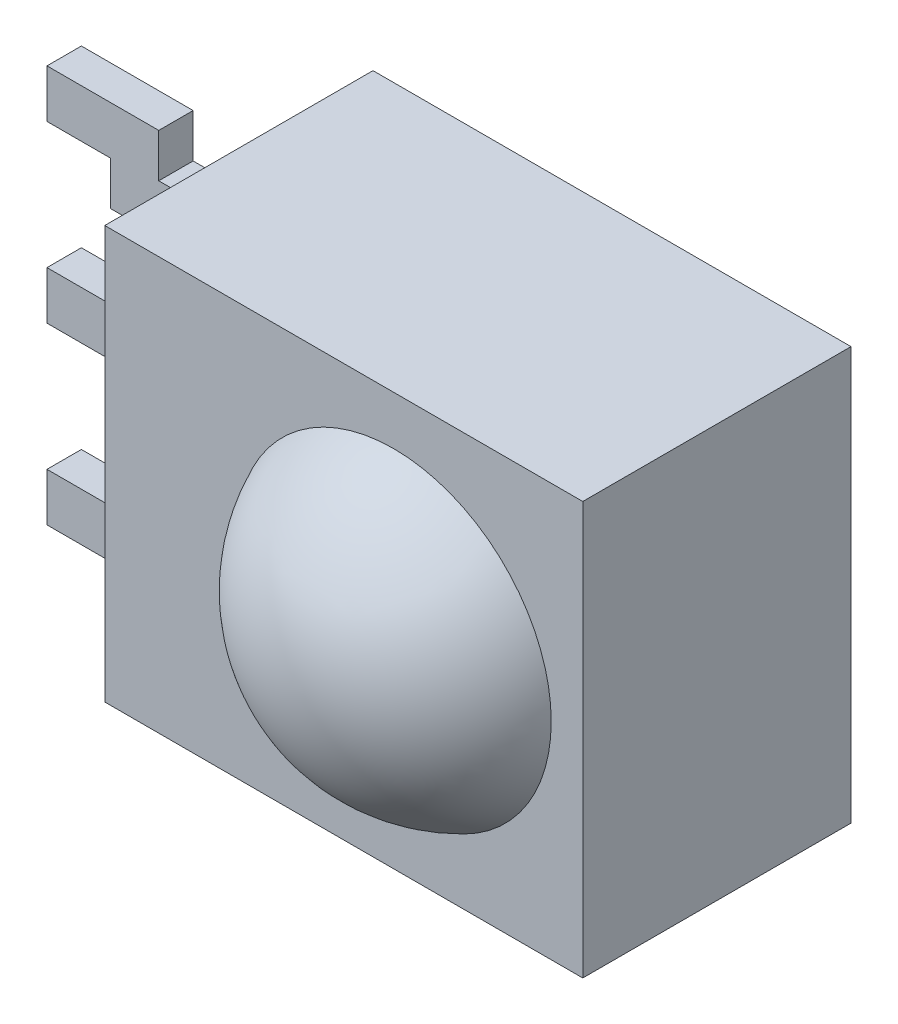
ISO-10303-21;
HEADER;
FILE_DESCRIPTION(('STEP AP214'),'2;1');
FILE_NAME('part.step','',(''),(''),'','','');
FILE_SCHEMA(('AUTOMOTIVE_DESIGN { 1 0 10303 214 1 1 1 1 }'));
ENDSEC;
DATA;
#1=APPLICATION_CONTEXT('core data for automotive mechanical design processes');
#2=APPLICATION_PROTOCOL_DEFINITION('international standard','automotive_design',2000,#1);
#3=PRODUCT_CONTEXT('',#1,'mechanical');
#4=PRODUCT('Part','Part','',(#3));
#5=PRODUCT_RELATED_PRODUCT_CATEGORY('part','',(#4));
#6=PRODUCT_DEFINITION_FORMATION('','',#4);
#7=PRODUCT_DEFINITION_CONTEXT('part definition',#1,'design');
#8=PRODUCT_DEFINITION('design','',#6,#7);
#9=PRODUCT_DEFINITION_SHAPE('','',#8);
#10=(LENGTH_UNIT() NAMED_UNIT(*) SI_UNIT(.MILLI.,.METRE.));
#11=(NAMED_UNIT(*) PLANE_ANGLE_UNIT() SI_UNIT($,.RADIAN.));
#12=(NAMED_UNIT(*) SI_UNIT($,.STERADIAN.) SOLID_ANGLE_UNIT());
#13=UNCERTAINTY_MEASURE_WITH_UNIT(LENGTH_MEASURE(1.E-05),#10,'distance_accuracy_value','');
#14=(GEOMETRIC_REPRESENTATION_CONTEXT(3) GLOBAL_UNCERTAINTY_ASSIGNED_CONTEXT((#13)) GLOBAL_UNIT_ASSIGNED_CONTEXT((#10,
#11,#12)) REPRESENTATION_CONTEXT('',''));
#15=CARTESIAN_POINT('',(0.,0.,0.));
#16=DIRECTION('',(0.,0.,1.));
#17=DIRECTION('',(1.,0.,0.));
#18=AXIS2_PLACEMENT_3D('',#15,#16,#17);
#19=CARTESIAN_POINT('',(-6.01499999999999,3.6678429995562,21.2054494009789));
#20=DIRECTION('',(1.,0.,0.));
#21=DIRECTION('',(0.,1.,0.));
#22=AXIS2_PLACEMENT_3D('',#19,#20,#21);
#23=PLANE('',#22);
#24=DIRECTION('',(0.,1.,0.));
#25=VECTOR('',#24,1.);
#26=CARTESIAN_POINT('',(-6.01499999999999,-1.555,-0.25));
#27=LINE('',#26,#25);
#28=CARTESIAN_POINT('',(-6.01499999999999,-2.89,-0.25));
#29=VERTEX_POINT('',#28);
#30=CARTESIAN_POINT('',(-6.01499999999999,-2.19,-0.25));
#31=VERTEX_POINT('',#30);
#32=EDGE_CURVE('E121',#29,#31,#27,.T.);
#33=ORIENTED_EDGE('',*,*,#32,.F.);
#34=DIRECTION('',(0.,0.,-1.));
#35=VECTOR('',#34,1.);
#36=CARTESIAN_POINT('',(-6.01499999999999,-2.89,-0.25));
#37=LINE('',#36,#35);
#38=CARTESIAN_POINT('',(-6.01499999999999,-2.89,0.25));
#39=VERTEX_POINT('',#38);
#40=EDGE_CURVE('E62',#39,#29,#37,.T.);
#41=ORIENTED_EDGE('',*,*,#40,.F.);
#42=DIRECTION('',(0.,-1.,0.));
#43=VECTOR('',#42,1.);
#44=CARTESIAN_POINT('',(-6.01499999999999,-1.555,0.25));
#45=LINE('',#44,#43);
#46=CARTESIAN_POINT('',(-6.01499999999999,-2.19,0.25));
#47=VERTEX_POINT('',#46);
#48=EDGE_CURVE('E13',#47,#39,#45,.T.);
#49=ORIENTED_EDGE('',*,*,#48,.F.);
#50=DIRECTION('',(0.,0.,1.));
#51=VECTOR('',#50,1.);
#52=CARTESIAN_POINT('',(-6.01499999999999,-2.19,-0.25));
#53=LINE('',#52,#51);
#54=EDGE_CURVE('E109',#31,#47,#53,.T.);
#55=ORIENTED_EDGE('',*,*,#54,.F.);
#56=EDGE_LOOP('',(#33,#41,#49,#55));
#57=FACE_BOUND('',#56,.T.);
#58=ADVANCED_FACE('F47',(#57),#23,.F.);
#59=CARTESIAN_POINT('',(-5.60023252670426,-1.555,-0.25));
#60=DIRECTION('',(0.,0.,1.));
#61=DIRECTION('',(1.,0.,0.));
#62=AXIS2_PLACEMENT_3D('',#59,#60,#61);
#63=PLANE('',#62);
#64=DIRECTION('',(-1.,0.,0.));
#65=VECTOR('',#64,1.);
#66=CARTESIAN_POINT('',(-4.38999999999999,-2.89,-0.25));
#67=LINE('',#66,#65);
#68=CARTESIAN_POINT('',(-4.38999999999999,-2.89,-0.25));
#69=VERTEX_POINT('',#68);
#70=EDGE_CURVE('E55',#69,#29,#67,.T.);
#71=ORIENTED_EDGE('',*,*,#70,.T.);
#72=ORIENTED_EDGE('',*,*,#32,.T.);
#73=DIRECTION('',(-1.,0.,0.));
#74=VECTOR('',#73,1.);
#75=CARTESIAN_POINT('',(-5.08999999999999,-2.19,-0.25));
#76=LINE('',#75,#74);
#77=CARTESIAN_POINT('',(-5.08999999999999,-2.19,-0.25));
#78=VERTEX_POINT('',#77);
#79=EDGE_CURVE('E120',#78,#31,#76,.T.);
#80=ORIENTED_EDGE('',*,*,#79,.F.);
#81=DIRECTION('',(0.,-1.,0.));
#82=VECTOR('',#81,1.);
#83=CARTESIAN_POINT('',(-5.08999999999999,-1.555,-0.25));
#84=LINE('',#83,#82);
#85=CARTESIAN_POINT('',(-5.08999999999999,-1.555,-0.25));
#86=VERTEX_POINT('',#85);
#87=EDGE_CURVE('E147',#86,#78,#84,.T.);
#88=ORIENTED_EDGE('',*,*,#87,.F.);
#89=DIRECTION('',(1.,0.,0.));
#90=VECTOR('',#89,1.);
#91=CARTESIAN_POINT('',(-5.60023252670426,-1.555,-0.25));
#92=LINE('',#91,#90);
#93=CARTESIAN_POINT('',(-3.47499999999999,-1.555,-0.25));
#94=VERTEX_POINT('',#93);
#95=EDGE_CURVE('E163',#86,#94,#92,.T.);
#96=ORIENTED_EDGE('',*,*,#95,.T.);
#97=DIRECTION('',(0.,-1.,0.));
#98=VECTOR('',#97,1.);
#99=CARTESIAN_POINT('',(-3.47499999999999,-1.555,-0.25));
#100=LINE('',#99,#98);
#101=CARTESIAN_POINT('',(-3.47499999999999,-2.255,-0.25));
#102=VERTEX_POINT('',#101);
#103=EDGE_CURVE('E174',#94,#102,#100,.T.);
#104=ORIENTED_EDGE('',*,*,#103,.T.);
#105=DIRECTION('',(1.,0.,0.));
#106=VECTOR('',#105,1.);
#107=CARTESIAN_POINT('',(-5.60023252670426,-2.255,-0.25));
#108=LINE('',#107,#106);
#109=CARTESIAN_POINT('',(-4.38999999999999,-2.255,-0.25));
#110=VERTEX_POINT('',#109);
#111=EDGE_CURVE('E143',#110,#102,#108,.T.);
#112=ORIENTED_EDGE('',*,*,#111,.F.);
#113=DIRECTION('',(0.,-1.,0.));
#114=VECTOR('',#113,1.);
#115=CARTESIAN_POINT('',(-4.38999999999999,-2.255,-0.25));
#116=LINE('',#115,#114);
#117=EDGE_CURVE('E141',#110,#69,#116,.T.);
#118=ORIENTED_EDGE('',*,*,#117,.T.);
#119=EDGE_LOOP('',(#71,#72,#80,#88,#96,#104,#112,#118));
#120=FACE_BOUND('',#119,.T.);
#121=ADVANCED_FACE('F139',(#120),#63,.F.);
#122=CARTESIAN_POINT('',(-5.08999999999999,-2.19,-0.25));
#123=DIRECTION('',(0.,-1.,0.));
#124=DIRECTION('',(0.,0.,-1.));
#125=AXIS2_PLACEMENT_3D('',#122,#123,#124);
#126=PLANE('',#125);
#127=ORIENTED_EDGE('',*,*,#79,.T.);
#128=ORIENTED_EDGE('',*,*,#54,.T.);
#129=DIRECTION('',(-1.,0.,0.));
#130=VECTOR('',#129,1.);
#131=CARTESIAN_POINT('',(-5.08999999999999,-2.19,0.25));
#132=LINE('',#131,#130);
#133=CARTESIAN_POINT('',(-5.08999999999999,-2.19,0.25));
#134=VERTEX_POINT('',#133);
#135=EDGE_CURVE('E118',#134,#47,#132,.T.);
#136=ORIENTED_EDGE('',*,*,#135,.F.);
#137=DIRECTION('',(0.,0.,1.));
#138=VECTOR('',#137,1.);
#139=CARTESIAN_POINT('',(-5.08999999999999,-2.19,-0.25));
#140=LINE('',#139,#138);
#141=EDGE_CURVE('E151',#78,#134,#140,.T.);
#142=ORIENTED_EDGE('',*,*,#141,.F.);
#143=EDGE_LOOP('',(#127,#128,#136,#142));
#144=FACE_BOUND('',#143,.T.);
#145=ADVANCED_FACE('F116',(#144),#126,.F.);
#146=CARTESIAN_POINT('',(-4.38999999999999,-2.89,-0.25));
#147=DIRECTION('',(0.,1.,0.));
#148=DIRECTION('',(0.,0.,1.));
#149=AXIS2_PLACEMENT_3D('',#146,#147,#148);
#150=PLANE('',#149);
#151=DIRECTION('',(-1.,0.,0.));
#152=VECTOR('',#151,1.);
#153=CARTESIAN_POINT('',(-4.38999999999999,-2.89,0.25));
#154=LINE('',#153,#152);
#155=CARTESIAN_POINT('',(-4.38999999999999,-2.89,0.25));
#156=VERTEX_POINT('',#155);
#157=EDGE_CURVE('E127',#156,#39,#154,.T.);
#158=ORIENTED_EDGE('',*,*,#157,.T.);
#159=ORIENTED_EDGE('',*,*,#40,.T.);
#160=ORIENTED_EDGE('',*,*,#70,.F.);
#161=DIRECTION('',(0.,0.,-1.));
#162=VECTOR('',#161,1.);
#163=CARTESIAN_POINT('',(-4.38999999999999,-2.89,-0.25));
#164=LINE('',#163,#162);
#165=EDGE_CURVE('E130',#156,#69,#164,.T.);
#166=ORIENTED_EDGE('',*,*,#165,.F.);
#167=EDGE_LOOP('',(#158,#159,#160,#166));
#168=FACE_BOUND('',#167,.T.);
#169=ADVANCED_FACE('F49',(#168),#150,.F.);
#170=CARTESIAN_POINT('',(-5.08999999999999,-1.555,-0.25));
#171=DIRECTION('',(-1.,0.,0.));
#172=DIRECTION('',(0.,0.,1.));
#173=AXIS2_PLACEMENT_3D('',#170,#171,#172);
#174=PLANE('',#173);
#175=ORIENTED_EDGE('',*,*,#87,.T.);
#176=ORIENTED_EDGE('',*,*,#141,.T.);
#177=DIRECTION('',(0.,-1.,0.));
#178=VECTOR('',#177,1.);
#179=CARTESIAN_POINT('',(-5.08999999999999,-1.555,0.25));
#180=LINE('',#179,#178);
#181=CARTESIAN_POINT('',(-5.08999999999999,-1.555,0.25));
#182=VERTEX_POINT('',#181);
#183=EDGE_CURVE('E125',#182,#134,#180,.T.);
#184=ORIENTED_EDGE('',*,*,#183,.F.);
#185=DIRECTION('',(0.,0.,-1.));
#186=VECTOR('',#185,1.);
#187=CARTESIAN_POINT('',(-5.08999999999999,-1.555,-0.25));
#188=LINE('',#187,#186);
#189=EDGE_CURVE('E156',#182,#86,#188,.T.);
#190=ORIENTED_EDGE('',*,*,#189,.T.);
#191=EDGE_LOOP('',(#175,#176,#184,#190));
#192=FACE_BOUND('',#191,.T.);
#193=ADVANCED_FACE('F197',(#192),#174,.T.);
#194=CARTESIAN_POINT('',(-4.38999999999999,-2.255,-0.25));
#195=DIRECTION('',(1.,0.,0.));
#196=DIRECTION('',(0.,0.,-1.));
#197=AXIS2_PLACEMENT_3D('',#194,#195,#196);
#198=PLANE('',#197);
#199=DIRECTION('',(0.,-1.,0.));
#200=VECTOR('',#199,1.);
#201=CARTESIAN_POINT('',(-4.38999999999999,-2.255,0.25));
#202=LINE('',#201,#200);
#203=CARTESIAN_POINT('',(-4.38999999999999,-2.255,0.25));
#204=VERTEX_POINT('',#203);
#205=EDGE_CURVE('E148',#204,#156,#202,.T.);
#206=ORIENTED_EDGE('',*,*,#205,.T.);
#207=ORIENTED_EDGE('',*,*,#165,.T.);
#208=ORIENTED_EDGE('',*,*,#117,.F.);
#209=DIRECTION('',(0.,0.,1.));
#210=VECTOR('',#209,1.);
#211=CARTESIAN_POINT('',(-4.38999999999999,-2.255,-0.25));
#212=LINE('',#211,#210);
#213=EDGE_CURVE('E158',#110,#204,#212,.T.);
#214=ORIENTED_EDGE('',*,*,#213,.T.);
#215=EDGE_LOOP('',(#206,#207,#208,#214));
#216=FACE_BOUND('',#215,.T.);
#217=ADVANCED_FACE('F183',(#216),#198,.T.);
#218=CARTESIAN_POINT('',(-5.60023252670426,-1.555,-0.25));
#219=DIRECTION('',(0.,-1.,0.));
#220=DIRECTION('',(1.,0.,0.));
#221=AXIS2_PLACEMENT_3D('',#218,#219,#220);
#222=PLANE('',#221);
#223=ORIENTED_EDGE('',*,*,#189,.F.);
#224=DIRECTION('',(1.,0.,0.));
#225=VECTOR('',#224,1.);
#226=CARTESIAN_POINT('',(-5.60023252670426,-1.555,0.25));
#227=LINE('',#226,#225);
#228=CARTESIAN_POINT('',(-3.47499999999999,-1.555,0.25));
#229=VERTEX_POINT('',#228);
#230=EDGE_CURVE('E161',#182,#229,#227,.T.);
#231=ORIENTED_EDGE('',*,*,#230,.T.);
#232=DIRECTION('',(0.,0.,-1.));
#233=VECTOR('',#232,1.);
#234=CARTESIAN_POINT('',(-3.47499999999999,-1.555,-0.25));
#235=LINE('',#234,#233);
#236=EDGE_CURVE('E165',#229,#94,#235,.T.);
#237=ORIENTED_EDGE('',*,*,#236,.T.);
#238=ORIENTED_EDGE('',*,*,#95,.F.);
#239=EDGE_LOOP('',(#223,#231,#237,#238));
#240=FACE_BOUND('',#239,.T.);
#241=ADVANCED_FACE('F194',(#240),#222,.F.);
#242=CARTESIAN_POINT('',(-5.60023252670426,-1.555,0.25));
#243=DIRECTION('',(0.,0.,-1.));
#244=DIRECTION('',(-1.,0.,0.));
#245=AXIS2_PLACEMENT_3D('',#242,#243,#244);
#246=PLANE('',#245);
#247=ORIENTED_EDGE('',*,*,#135,.T.);
#248=ORIENTED_EDGE('',*,*,#48,.T.);
#249=ORIENTED_EDGE('',*,*,#157,.F.);
#250=ORIENTED_EDGE('',*,*,#205,.F.);
#251=DIRECTION('',(1.,0.,0.));
#252=VECTOR('',#251,1.);
#253=CARTESIAN_POINT('',(-5.60023252670426,-2.255,0.25));
#254=LINE('',#253,#252);
#255=CARTESIAN_POINT('',(-3.47499999999999,-2.255,0.25));
#256=VERTEX_POINT('',#255);
#257=EDGE_CURVE('E159',#204,#256,#254,.T.);
#258=ORIENTED_EDGE('',*,*,#257,.T.);
#259=DIRECTION('',(0.,1.,0.));
#260=VECTOR('',#259,1.);
#261=CARTESIAN_POINT('',(-3.47499999999999,-1.555,0.25));
#262=LINE('',#261,#260);
#263=EDGE_CURVE('E168',#256,#229,#262,.T.);
#264=ORIENTED_EDGE('',*,*,#263,.T.);
#265=ORIENTED_EDGE('',*,*,#230,.F.);
#266=ORIENTED_EDGE('',*,*,#183,.T.);
#267=EDGE_LOOP('',(#247,#248,#249,#250,#258,#264,#265,#266));
#268=FACE_BOUND('',#267,.T.);
#269=ADVANCED_FACE('F123',(#268),#246,.F.);
#270=CARTESIAN_POINT('',(-5.60023252670426,-2.255,-0.25));
#271=DIRECTION('',(0.,1.,0.));
#272=DIRECTION('',(-1.,0.,0.));
#273=AXIS2_PLACEMENT_3D('',#270,#271,#272);
#274=PLANE('',#273);
#275=ORIENTED_EDGE('',*,*,#213,.F.);
#276=ORIENTED_EDGE('',*,*,#111,.T.);
#277=DIRECTION('',(0.,0.,1.));
#278=VECTOR('',#277,1.);
#279=CARTESIAN_POINT('',(-3.47499999999999,-2.255,-0.25));
#280=LINE('',#279,#278);
#281=EDGE_CURVE('E171',#102,#256,#280,.T.);
#282=ORIENTED_EDGE('',*,*,#281,.T.);
#283=ORIENTED_EDGE('',*,*,#257,.F.);
#284=EDGE_LOOP('',(#275,#276,#282,#283));
#285=FACE_BOUND('',#284,.T.);
#286=ADVANCED_FACE('F185',(#285),#274,.F.);
#287=CARTESIAN_POINT('',(-3.47499999999999,-2.255,-0.25));
#288=DIRECTION('',(-1.,0.,0.));
#289=DIRECTION('',(0.,0.,1.));
#290=AXIS2_PLACEMENT_3D('',#287,#288,#289);
#291=PLANE('',#290);
#292=ORIENTED_EDGE('',*,*,#103,.F.);
#293=ORIENTED_EDGE('',*,*,#236,.F.);
#294=ORIENTED_EDGE('',*,*,#263,.F.);
#295=ORIENTED_EDGE('',*,*,#281,.F.);
#296=EDGE_LOOP('',(#292,#293,#294,#295));
#297=FACE_BOUND('',#296,.T.);
#298=ADVANCED_FACE('F191',(#297),#291,.F.);
#299=CLOSED_SHELL('',(#58,#121,#145,#169,#193,#217,#241,#269,#286,#298));
#300=MANIFOLD_SOLID_BREP('B2',#299);
#301=CARTESIAN_POINT('',(-6.01499999999999,3.6678429995562,21.2054494009789));
#302=DIRECTION('',(1.,0.,0.));
#303=DIRECTION('',(0.,1.,0.));
#304=AXIS2_PLACEMENT_3D('',#301,#302,#303);
#305=PLANE('',#304);
#306=DIRECTION('',(0.,1.,0.));
#307=VECTOR('',#306,1.);
#308=CARTESIAN_POINT('',(-6.01499999999999,0.35,-0.25));
#309=LINE('',#308,#307);
#310=CARTESIAN_POINT('',(-6.01499999999999,-0.35,-0.25));
#311=VERTEX_POINT('',#310);
#312=CARTESIAN_POINT('',(-6.01499999999999,0.35,-0.25));
#313=VERTEX_POINT('',#312);
#314=EDGE_CURVE('E353',#311,#313,#309,.T.);
#315=ORIENTED_EDGE('',*,*,#314,.F.);
#316=DIRECTION('',(0.,0.,-1.));
#317=VECTOR('',#316,1.);
#318=CARTESIAN_POINT('',(-6.01499999999999,-0.35,-0.25));
#319=LINE('',#318,#317);
#320=CARTESIAN_POINT('',(-6.01499999999999,-0.35,0.25));
#321=VERTEX_POINT('',#320);
#322=EDGE_CURVE('E357',#321,#311,#319,.T.);
#323=ORIENTED_EDGE('',*,*,#322,.F.);
#324=DIRECTION('',(0.,-1.,0.));
#325=VECTOR('',#324,1.);
#326=CARTESIAN_POINT('',(-6.01499999999999,0.35,0.25));
#327=LINE('',#326,#325);
#328=CARTESIAN_POINT('',(-6.01499999999999,0.35,0.25));
#329=VERTEX_POINT('',#328);
#330=EDGE_CURVE('E323',#329,#321,#327,.T.);
#331=ORIENTED_EDGE('',*,*,#330,.F.);
#332=DIRECTION('',(0.,0.,1.));
#333=VECTOR('',#332,1.);
#334=CARTESIAN_POINT('',(-6.01499999999999,0.35,-0.25));
#335=LINE('',#334,#333);
#336=EDGE_CURVE('E45',#313,#329,#335,.T.);
#337=ORIENTED_EDGE('',*,*,#336,.F.);
#338=EDGE_LOOP('',(#315,#323,#331,#337));
#339=FACE_BOUND('',#338,.T.);
#340=ADVANCED_FACE('F306',(#339),#305,.F.);
#341=CARTESIAN_POINT('',(-9.09773252670426,0.35,-0.25));
#342=DIRECTION('',(0.,0.,1.));
#343=DIRECTION('',(1.,0.,0.));
#344=AXIS2_PLACEMENT_3D('',#341,#342,#343);
#345=PLANE('',#344);
#346=DIRECTION('',(1.,0.,0.));
#347=VECTOR('',#346,1.);
#348=CARTESIAN_POINT('',(-9.09773252670426,-0.35,-0.25));
#349=LINE('',#348,#347);
#350=CARTESIAN_POINT('',(-3.47499999999999,-0.35,-0.25));
#351=VERTEX_POINT('',#350);
#352=EDGE_CURVE('E310',#311,#351,#349,.T.);
#353=ORIENTED_EDGE('',*,*,#352,.F.);
#354=ORIENTED_EDGE('',*,*,#314,.T.);
#355=DIRECTION('',(1.,0.,0.));
#356=VECTOR('',#355,1.);
#357=CARTESIAN_POINT('',(-9.09773252670426,0.35,-0.25));
#358=LINE('',#357,#356);
#359=CARTESIAN_POINT('',(-3.47499999999999,0.35,-0.25));
#360=VERTEX_POINT('',#359);
#361=EDGE_CURVE('E350',#313,#360,#358,.T.);
#362=ORIENTED_EDGE('',*,*,#361,.T.);
#363=DIRECTION('',(0.,-1.,0.));
#364=VECTOR('',#363,1.);
#365=CARTESIAN_POINT('',(-3.47499999999999,0.35,-0.25));
#366=LINE('',#365,#364);
#367=EDGE_CURVE('E362',#360,#351,#366,.T.);
#368=ORIENTED_EDGE('',*,*,#367,.T.);
#369=EDGE_LOOP('',(#353,#354,#362,#368));
#370=FACE_BOUND('',#369,.T.);
#371=ADVANCED_FACE('F308',(#370),#345,.F.);
#372=CARTESIAN_POINT('',(-9.09773252670426,-0.35,-0.25));
#373=DIRECTION('',(0.,1.,0.));
#374=DIRECTION('',(0.,0.,1.));
#375=AXIS2_PLACEMENT_3D('',#372,#373,#374);
#376=PLANE('',#375);
#377=DIRECTION('',(1.,0.,0.));
#378=VECTOR('',#377,1.);
#379=CARTESIAN_POINT('',(-9.09773252670426,-0.35,0.25));
#380=LINE('',#379,#378);
#381=CARTESIAN_POINT('',(-3.47499999999999,-0.35,0.25));
#382=VERTEX_POINT('',#381);
#383=EDGE_CURVE('E370',#321,#382,#380,.T.);
#384=ORIENTED_EDGE('',*,*,#383,.F.);
#385=ORIENTED_EDGE('',*,*,#322,.T.);
#386=ORIENTED_EDGE('',*,*,#352,.T.);
#387=DIRECTION('',(0.,0.,1.));
#388=VECTOR('',#387,1.);
#389=CARTESIAN_POINT('',(-3.47499999999999,-0.35,-0.25));
#390=LINE('',#389,#388);
#391=EDGE_CURVE('E371',#351,#382,#390,.T.);
#392=ORIENTED_EDGE('',*,*,#391,.T.);
#393=EDGE_LOOP('',(#384,#385,#386,#392));
#394=FACE_BOUND('',#393,.T.);
#395=ADVANCED_FACE('F381',(#394),#376,.F.);
#396=CARTESIAN_POINT('',(-9.09773252670426,0.35,0.25));
#397=DIRECTION('',(0.,0.,-1.));
#398=DIRECTION('',(-1.,0.,0.));
#399=AXIS2_PLACEMENT_3D('',#396,#397,#398);
#400=PLANE('',#399);
#401=DIRECTION('',(1.,0.,0.));
#402=VECTOR('',#401,1.);
#403=CARTESIAN_POINT('',(-9.09773252670426,0.35,0.25));
#404=LINE('',#403,#402);
#405=CARTESIAN_POINT('',(-3.47499999999999,0.35,0.25));
#406=VERTEX_POINT('',#405);
#407=EDGE_CURVE('E330',#329,#406,#404,.T.);
#408=ORIENTED_EDGE('',*,*,#407,.F.);
#409=ORIENTED_EDGE('',*,*,#330,.T.);
#410=ORIENTED_EDGE('',*,*,#383,.T.);
#411=DIRECTION('',(0.,1.,0.));
#412=VECTOR('',#411,1.);
#413=CARTESIAN_POINT('',(-3.47499999999999,0.35,0.25));
#414=LINE('',#413,#412);
#415=EDGE_CURVE('E369',#382,#406,#414,.T.);
#416=ORIENTED_EDGE('',*,*,#415,.T.);
#417=EDGE_LOOP('',(#408,#409,#410,#416));
#418=FACE_BOUND('',#417,.T.);
#419=ADVANCED_FACE('F380',(#418),#400,.F.);
#420=CARTESIAN_POINT('',(-9.09773252670426,0.35,-0.25));
#421=DIRECTION('',(0.,-1.,0.));
#422=DIRECTION('',(0.,0.,-1.));
#423=AXIS2_PLACEMENT_3D('',#420,#421,#422);
#424=PLANE('',#423);
#425=ORIENTED_EDGE('',*,*,#361,.F.);
#426=ORIENTED_EDGE('',*,*,#336,.T.);
#427=ORIENTED_EDGE('',*,*,#407,.T.);
#428=DIRECTION('',(0.,0.,-1.));
#429=VECTOR('',#428,1.);
#430=CARTESIAN_POINT('',(-3.47499999999999,0.35,-0.25));
#431=LINE('',#430,#429);
#432=EDGE_CURVE('E316',#406,#360,#431,.T.);
#433=ORIENTED_EDGE('',*,*,#432,.T.);
#434=EDGE_LOOP('',(#425,#426,#427,#433));
#435=FACE_BOUND('',#434,.T.);
#436=ADVANCED_FACE('F359',(#435),#424,.F.);
#437=CARTESIAN_POINT('',(-3.47499999999999,-0.35,-0.25));
#438=DIRECTION('',(-1.,0.,0.));
#439=DIRECTION('',(0.,0.,1.));
#440=AXIS2_PLACEMENT_3D('',#437,#438,#439);
#441=PLANE('',#440);
#442=ORIENTED_EDGE('',*,*,#367,.F.);
#443=ORIENTED_EDGE('',*,*,#432,.F.);
#444=ORIENTED_EDGE('',*,*,#415,.F.);
#445=ORIENTED_EDGE('',*,*,#391,.F.);
#446=EDGE_LOOP('',(#442,#443,#444,#445));
#447=FACE_BOUND('',#446,.T.);
#448=ADVANCED_FACE('F384',(#447),#441,.F.);
#449=CLOSED_SHELL('',(#340,#371,#395,#419,#436,#448));
#450=MANIFOLD_SOLID_BREP('B7',#449);
#451=CARTESIAN_POINT('',(-6.01499999999999,3.6678429995562,21.2054494009789));
#452=DIRECTION('',(1.,0.,0.));
#453=DIRECTION('',(0.,1.,0.));
#454=AXIS2_PLACEMENT_3D('',#451,#452,#453);
#455=PLANE('',#454);
#456=DIRECTION('',(0.,1.,0.));
#457=VECTOR('',#456,1.);
#458=CARTESIAN_POINT('',(-6.01499999999999,2.255,-0.25));
#459=LINE('',#458,#457);
#460=CARTESIAN_POINT('',(-6.01499999999999,2.19,-0.25));
#461=VERTEX_POINT('',#460);
#462=CARTESIAN_POINT('',(-6.01499999999999,2.89,-0.25));
#463=VERTEX_POINT('',#462);
#464=EDGE_CURVE('E522',#461,#463,#459,.T.);
#465=ORIENTED_EDGE('',*,*,#464,.F.);
#466=DIRECTION('',(0.,0.,-1.));
#467=VECTOR('',#466,1.);
#468=CARTESIAN_POINT('',(-6.01499999999999,2.19,-0.25));
#469=LINE('',#468,#467);
#470=CARTESIAN_POINT('',(-6.01499999999999,2.19,0.25));
#471=VERTEX_POINT('',#470);
#472=EDGE_CURVE('E463',#471,#461,#469,.T.);
#473=ORIENTED_EDGE('',*,*,#472,.F.);
#474=DIRECTION('',(0.,-1.,0.));
#475=VECTOR('',#474,1.);
#476=CARTESIAN_POINT('',(-6.01499999999999,2.255,0.25));
#477=LINE('',#476,#475);
#478=CARTESIAN_POINT('',(-6.01499999999999,2.89,0.25));
#479=VERTEX_POINT('',#478);
#480=EDGE_CURVE('E304',#479,#471,#477,.T.);
#481=ORIENTED_EDGE('',*,*,#480,.F.);
#482=DIRECTION('',(0.,0.,1.));
#483=VECTOR('',#482,1.);
#484=CARTESIAN_POINT('',(-6.01499999999999,2.89,-0.25));
#485=LINE('',#484,#483);
#486=EDGE_CURVE('E510',#463,#479,#485,.T.);
#487=ORIENTED_EDGE('',*,*,#486,.F.);
#488=EDGE_LOOP('',(#465,#473,#481,#487));
#489=FACE_BOUND('',#488,.T.);
#490=ADVANCED_FACE('F448',(#489),#455,.F.);
#491=CARTESIAN_POINT('',(-5.60023252670426,2.255,-0.25));
#492=DIRECTION('',(0.,0.,1.));
#493=DIRECTION('',(1.,0.,0.));
#494=AXIS2_PLACEMENT_3D('',#491,#492,#493);
#495=PLANE('',#494);
#496=DIRECTION('',(-1.,0.,0.));
#497=VECTOR('',#496,1.);
#498=CARTESIAN_POINT('',(-5.08999999999999,2.19,-0.25));
#499=LINE('',#498,#497);
#500=CARTESIAN_POINT('',(-5.08999999999999,2.19,-0.25));
#501=VERTEX_POINT('',#500);
#502=EDGE_CURVE('E456',#501,#461,#499,.T.);
#503=ORIENTED_EDGE('',*,*,#502,.T.);
#504=ORIENTED_EDGE('',*,*,#464,.T.);
#505=DIRECTION('',(-1.,0.,0.));
#506=VECTOR('',#505,1.);
#507=CARTESIAN_POINT('',(-4.38999999999999,2.89,-0.25));
#508=LINE('',#507,#506);
#509=CARTESIAN_POINT('',(-4.38999999999999,2.89,-0.25));
#510=VERTEX_POINT('',#509);
#511=EDGE_CURVE('E521',#510,#463,#508,.T.);
#512=ORIENTED_EDGE('',*,*,#511,.F.);
#513=DIRECTION('',(0.,1.,0.));
#514=VECTOR('',#513,1.);
#515=CARTESIAN_POINT('',(-4.38999999999999,2.255,-0.25));
#516=LINE('',#515,#514);
#517=CARTESIAN_POINT('',(-4.38999999999999,2.255,-0.25));
#518=VERTEX_POINT('',#517);
#519=EDGE_CURVE('E548',#518,#510,#516,.T.);
#520=ORIENTED_EDGE('',*,*,#519,.F.);
#521=DIRECTION('',(1.,0.,0.));
#522=VECTOR('',#521,1.);
#523=CARTESIAN_POINT('',(-5.60023252670426,2.255,-0.25));
#524=LINE('',#523,#522);
#525=CARTESIAN_POINT('',(-3.47499999999999,2.255,-0.25));
#526=VERTEX_POINT('',#525);
#527=EDGE_CURVE('E564',#518,#526,#524,.T.);
#528=ORIENTED_EDGE('',*,*,#527,.T.);
#529=DIRECTION('',(0.,-1.,0.));
#530=VECTOR('',#529,1.);
#531=CARTESIAN_POINT('',(-3.47499999999999,2.255,-0.25));
#532=LINE('',#531,#530);
#533=CARTESIAN_POINT('',(-3.47499999999999,1.555,-0.25));
#534=VERTEX_POINT('',#533);
#535=EDGE_CURVE('E575',#526,#534,#532,.T.);
#536=ORIENTED_EDGE('',*,*,#535,.T.);
#537=DIRECTION('',(1.,0.,0.));
#538=VECTOR('',#537,1.);
#539=CARTESIAN_POINT('',(-5.60023252670426,1.555,-0.25));
#540=LINE('',#539,#538);
#541=CARTESIAN_POINT('',(-5.08999999999999,1.555,-0.25));
#542=VERTEX_POINT('',#541);
#543=EDGE_CURVE('E544',#542,#534,#540,.T.);
#544=ORIENTED_EDGE('',*,*,#543,.F.);
#545=DIRECTION('',(0.,1.,0.));
#546=VECTOR('',#545,1.);
#547=CARTESIAN_POINT('',(-5.08999999999999,1.555,-0.25));
#548=LINE('',#547,#546);
#549=EDGE_CURVE('E542',#542,#501,#548,.T.);
#550=ORIENTED_EDGE('',*,*,#549,.T.);
#551=EDGE_LOOP('',(#503,#504,#512,#520,#528,#536,#544,#550));
#552=FACE_BOUND('',#551,.T.);
#553=ADVANCED_FACE('F540',(#552),#495,.F.);
#554=CARTESIAN_POINT('',(-4.38999999999999,2.89,-0.25));
#555=DIRECTION('',(0.,-1.,0.));
#556=DIRECTION('',(1.,0.,0.));
#557=AXIS2_PLACEMENT_3D('',#554,#555,#556);
#558=PLANE('',#557);
#559=ORIENTED_EDGE('',*,*,#511,.T.);
#560=ORIENTED_EDGE('',*,*,#486,.T.);
#561=DIRECTION('',(-1.,0.,0.));
#562=VECTOR('',#561,1.);
#563=CARTESIAN_POINT('',(-4.38999999999999,2.89,0.25));
#564=LINE('',#563,#562);
#565=CARTESIAN_POINT('',(-4.38999999999999,2.89,0.25));
#566=VERTEX_POINT('',#565);
#567=EDGE_CURVE('E519',#566,#479,#564,.T.);
#568=ORIENTED_EDGE('',*,*,#567,.F.);
#569=DIRECTION('',(0.,0.,1.));
#570=VECTOR('',#569,1.);
#571=CARTESIAN_POINT('',(-4.38999999999999,2.89,-0.25));
#572=LINE('',#571,#570);
#573=EDGE_CURVE('E552',#510,#566,#572,.T.);
#574=ORIENTED_EDGE('',*,*,#573,.F.);
#575=EDGE_LOOP('',(#559,#560,#568,#574));
#576=FACE_BOUND('',#575,.T.);
#577=ADVANCED_FACE('F517',(#576),#558,.F.);
#578=CARTESIAN_POINT('',(-5.08999999999999,2.19,-0.25));
#579=DIRECTION('',(0.,1.,0.));
#580=DIRECTION('',(-1.,0.,0.));
#581=AXIS2_PLACEMENT_3D('',#578,#579,#580);
#582=PLANE('',#581);
#583=DIRECTION('',(-1.,0.,0.));
#584=VECTOR('',#583,1.);
#585=CARTESIAN_POINT('',(-5.08999999999999,2.19,0.25));
#586=LINE('',#585,#584);
#587=CARTESIAN_POINT('',(-5.08999999999999,2.19,0.25));
#588=VERTEX_POINT('',#587);
#589=EDGE_CURVE('E528',#588,#471,#586,.T.);
#590=ORIENTED_EDGE('',*,*,#589,.T.);
#591=ORIENTED_EDGE('',*,*,#472,.T.);
#592=ORIENTED_EDGE('',*,*,#502,.F.);
#593=DIRECTION('',(0.,0.,-1.));
#594=VECTOR('',#593,1.);
#595=CARTESIAN_POINT('',(-5.08999999999999,2.19,-0.25));
#596=LINE('',#595,#594);
#597=EDGE_CURVE('E531',#588,#501,#596,.T.);
#598=ORIENTED_EDGE('',*,*,#597,.F.);
#599=EDGE_LOOP('',(#590,#591,#592,#598));
#600=FACE_BOUND('',#599,.T.);
#601=ADVANCED_FACE('F450',(#600),#582,.F.);
#602=CARTESIAN_POINT('',(-4.38999999999999,2.255,-0.25));
#603=DIRECTION('',(1.,0.,0.));
#604=DIRECTION('',(0.,0.,-1.));
#605=AXIS2_PLACEMENT_3D('',#602,#603,#604);
#606=PLANE('',#605);
#607=ORIENTED_EDGE('',*,*,#519,.T.);
#608=ORIENTED_EDGE('',*,*,#573,.T.);
#609=DIRECTION('',(0.,1.,0.));
#610=VECTOR('',#609,1.);
#611=CARTESIAN_POINT('',(-4.38999999999999,2.255,0.25));
#612=LINE('',#611,#610);
#613=CARTESIAN_POINT('',(-4.38999999999999,2.255,0.25));
#614=VERTEX_POINT('',#613);
#615=EDGE_CURVE('E526',#614,#566,#612,.T.);
#616=ORIENTED_EDGE('',*,*,#615,.F.);
#617=DIRECTION('',(0.,0.,-1.));
#618=VECTOR('',#617,1.);
#619=CARTESIAN_POINT('',(-4.38999999999999,2.255,-0.25));
#620=LINE('',#619,#618);
#621=EDGE_CURVE('E557',#614,#518,#620,.T.);
#622=ORIENTED_EDGE('',*,*,#621,.T.);
#623=EDGE_LOOP('',(#607,#608,#616,#622));
#624=FACE_BOUND('',#623,.T.);
#625=ADVANCED_FACE('F598',(#624),#606,.T.);
#626=CARTESIAN_POINT('',(-5.08999999999999,1.555,-0.25));
#627=DIRECTION('',(-1.,0.,0.));
#628=DIRECTION('',(0.,0.,1.));
#629=AXIS2_PLACEMENT_3D('',#626,#627,#628);
#630=PLANE('',#629);
#631=DIRECTION('',(0.,1.,0.));
#632=VECTOR('',#631,1.);
#633=CARTESIAN_POINT('',(-5.08999999999999,1.555,0.25));
#634=LINE('',#633,#632);
#635=CARTESIAN_POINT('',(-5.08999999999999,1.555,0.25));
#636=VERTEX_POINT('',#635);
#637=EDGE_CURVE('E549',#636,#588,#634,.T.);
#638=ORIENTED_EDGE('',*,*,#637,.T.);
#639=ORIENTED_EDGE('',*,*,#597,.T.);
#640=ORIENTED_EDGE('',*,*,#549,.F.);
#641=DIRECTION('',(0.,0.,1.));
#642=VECTOR('',#641,1.);
#643=CARTESIAN_POINT('',(-5.08999999999999,1.555,-0.25));
#644=LINE('',#643,#642);
#645=EDGE_CURVE('E559',#542,#636,#644,.T.);
#646=ORIENTED_EDGE('',*,*,#645,.T.);
#647=EDGE_LOOP('',(#638,#639,#640,#646));
#648=FACE_BOUND('',#647,.T.);
#649=ADVANCED_FACE('F584',(#648),#630,.T.);
#650=CARTESIAN_POINT('',(-5.60023252670426,2.255,-0.25));
#651=DIRECTION('',(0.,-1.,0.));
#652=DIRECTION('',(1.,0.,0.));
#653=AXIS2_PLACEMENT_3D('',#650,#651,#652);
#654=PLANE('',#653);
#655=ORIENTED_EDGE('',*,*,#621,.F.);
#656=DIRECTION('',(1.,0.,0.));
#657=VECTOR('',#656,1.);
#658=CARTESIAN_POINT('',(-5.60023252670426,2.255,0.25));
#659=LINE('',#658,#657);
#660=CARTESIAN_POINT('',(-3.47499999999999,2.255,0.25));
#661=VERTEX_POINT('',#660);
#662=EDGE_CURVE('E562',#614,#661,#659,.T.);
#663=ORIENTED_EDGE('',*,*,#662,.T.);
#664=DIRECTION('',(0.,0.,-1.));
#665=VECTOR('',#664,1.);
#666=CARTESIAN_POINT('',(-3.47499999999999,2.255,-0.25));
#667=LINE('',#666,#665);
#668=EDGE_CURVE('E566',#661,#526,#667,.T.);
#669=ORIENTED_EDGE('',*,*,#668,.T.);
#670=ORIENTED_EDGE('',*,*,#527,.F.);
#671=EDGE_LOOP('',(#655,#663,#669,#670));
#672=FACE_BOUND('',#671,.T.);
#673=ADVANCED_FACE('F595',(#672),#654,.F.);
#674=CARTESIAN_POINT('',(-5.60023252670426,2.255,0.25));
#675=DIRECTION('',(0.,0.,-1.));
#676=DIRECTION('',(-1.,0.,0.));
#677=AXIS2_PLACEMENT_3D('',#674,#675,#676);
#678=PLANE('',#677);
#679=ORIENTED_EDGE('',*,*,#567,.T.);
#680=ORIENTED_EDGE('',*,*,#480,.T.);
#681=ORIENTED_EDGE('',*,*,#589,.F.);
#682=ORIENTED_EDGE('',*,*,#637,.F.);
#683=DIRECTION('',(1.,0.,0.));
#684=VECTOR('',#683,1.);
#685=CARTESIAN_POINT('',(-5.60023252670426,1.555,0.25));
#686=LINE('',#685,#684);
#687=CARTESIAN_POINT('',(-3.47499999999999,1.555,0.25));
#688=VERTEX_POINT('',#687);
#689=EDGE_CURVE('E560',#636,#688,#686,.T.);
#690=ORIENTED_EDGE('',*,*,#689,.T.);
#691=DIRECTION('',(0.,1.,0.));
#692=VECTOR('',#691,1.);
#693=CARTESIAN_POINT('',(-3.47499999999999,2.255,0.25));
#694=LINE('',#693,#692);
#695=EDGE_CURVE('E569',#688,#661,#694,.T.);
#696=ORIENTED_EDGE('',*,*,#695,.T.);
#697=ORIENTED_EDGE('',*,*,#662,.F.);
#698=ORIENTED_EDGE('',*,*,#615,.T.);
#699=EDGE_LOOP('',(#679,#680,#681,#682,#690,#696,#697,#698));
#700=FACE_BOUND('',#699,.T.);
#701=ADVANCED_FACE('F524',(#700),#678,.F.);
#702=CARTESIAN_POINT('',(-5.60023252670426,1.555,-0.25));
#703=DIRECTION('',(0.,1.,0.));
#704=DIRECTION('',(-1.,0.,0.));
#705=AXIS2_PLACEMENT_3D('',#702,#703,#704);
#706=PLANE('',#705);
#707=ORIENTED_EDGE('',*,*,#645,.F.);
#708=ORIENTED_EDGE('',*,*,#543,.T.);
#709=DIRECTION('',(0.,0.,1.));
#710=VECTOR('',#709,1.);
#711=CARTESIAN_POINT('',(-3.47499999999999,1.555,-0.25));
#712=LINE('',#711,#710);
#713=EDGE_CURVE('E572',#534,#688,#712,.T.);
#714=ORIENTED_EDGE('',*,*,#713,.T.);
#715=ORIENTED_EDGE('',*,*,#689,.F.);
#716=EDGE_LOOP('',(#707,#708,#714,#715));
#717=FACE_BOUND('',#716,.T.);
#718=ADVANCED_FACE('F586',(#717),#706,.F.);
#719=CARTESIAN_POINT('',(-3.47499999999999,1.555,-0.25));
#720=DIRECTION('',(-1.,0.,0.));
#721=DIRECTION('',(0.,0.,1.));
#722=AXIS2_PLACEMENT_3D('',#719,#720,#721);
#723=PLANE('',#722);
#724=ORIENTED_EDGE('',*,*,#535,.F.);
#725=ORIENTED_EDGE('',*,*,#668,.F.);
#726=ORIENTED_EDGE('',*,*,#695,.F.);
#727=ORIENTED_EDGE('',*,*,#713,.F.);
#728=EDGE_LOOP('',(#724,#725,#726,#727));
#729=FACE_BOUND('',#728,.T.);
#730=ADVANCED_FACE('F592',(#729),#723,.F.);
#731=CLOSED_SHELL('',(#490,#553,#577,#601,#625,#649,#673,#701,#718,#730));
#732=MANIFOLD_SOLID_BREP('B39',#731);
#733=CARTESIAN_POINT('',(3.47500000000001,-3.,1.95));
#734=DIRECTION('',(-1.,0.,0.));
#735=DIRECTION('',(0.,0.,1.));
#736=AXIS2_PLACEMENT_3D('',#733,#734,#735);
#737=PLANE('',#736);
#738=DIRECTION('',(0.,1.,0.));
#739=VECTOR('',#738,1.);
#740=CARTESIAN_POINT('',(3.47500000000001,-3.,-1.95));
#741=LINE('',#740,#739);
#742=CARTESIAN_POINT('',(3.47500000000001,-3.,-1.95));
#743=VERTEX_POINT('',#742);
#744=CARTESIAN_POINT('',(3.47500000000001,3.,-1.95));
#745=VERTEX_POINT('',#744);
#746=EDGE_CURVE('E760',#743,#745,#741,.T.);
#747=ORIENTED_EDGE('',*,*,#746,.T.);
#748=DIRECTION('',(0.,0.,-1.));
#749=VECTOR('',#748,1.);
#750=CARTESIAN_POINT('',(3.47500000000001,3.,1.95));
#751=LINE('',#750,#749);
#752=CARTESIAN_POINT('',(3.47500000000001,3.,1.95));
#753=VERTEX_POINT('',#752);
#754=EDGE_CURVE('E446',#753,#745,#751,.T.);
#755=ORIENTED_EDGE('',*,*,#754,.F.);
#756=DIRECTION('',(0.,1.,0.));
#757=VECTOR('',#756,1.);
#758=CARTESIAN_POINT('',(3.47500000000001,-3.,1.95));
#759=LINE('',#758,#757);
#760=CARTESIAN_POINT('',(3.47500000000001,-3.,1.95));
#761=VERTEX_POINT('',#760);
#762=EDGE_CURVE('E748',#761,#753,#759,.T.);
#763=ORIENTED_EDGE('',*,*,#762,.F.);
#764=DIRECTION('',(0.,0.,-1.));
#765=VECTOR('',#764,1.);
#766=CARTESIAN_POINT('',(3.47500000000001,-3.,1.95));
#767=LINE('',#766,#765);
#768=EDGE_CURVE('E756',#761,#743,#767,.T.);
#769=ORIENTED_EDGE('',*,*,#768,.T.);
#770=EDGE_LOOP('',(#747,#755,#763,#769));
#771=FACE_BOUND('',#770,.T.);
#772=ADVANCED_FACE('F697',(#771),#737,.F.);
#773=CARTESIAN_POINT('',(-3.47499999999999,3.,1.95));
#774=DIRECTION('',(0.,-1.,0.));
#775=DIRECTION('',(0.,0.,-1.));
#776=AXIS2_PLACEMENT_3D('',#773,#774,#775);
#777=PLANE('',#776);
#778=DIRECTION('',(-1.,0.,0.));
#779=VECTOR('',#778,1.);
#780=CARTESIAN_POINT('',(-3.47499999999999,3.,-1.95));
#781=LINE('',#780,#779);
#782=CARTESIAN_POINT('',(-3.47499999999999,3.,-1.95));
#783=VERTEX_POINT('',#782);
#784=EDGE_CURVE('E752',#745,#783,#781,.T.);
#785=ORIENTED_EDGE('',*,*,#784,.T.);
#786=DIRECTION('',(0.,0.,-1.));
#787=VECTOR('',#786,1.);
#788=CARTESIAN_POINT('',(-3.47499999999999,3.,1.95));
#789=LINE('',#788,#787);
#790=CARTESIAN_POINT('',(-3.47499999999999,3.,1.95));
#791=VERTEX_POINT('',#790);
#792=EDGE_CURVE('E705',#791,#783,#789,.T.);
#793=ORIENTED_EDGE('',*,*,#792,.F.);
#794=DIRECTION('',(-1.,0.,0.));
#795=VECTOR('',#794,1.);
#796=CARTESIAN_POINT('',(-3.47499999999999,3.,1.95));
#797=LINE('',#796,#795);
#798=EDGE_CURVE('E743',#753,#791,#797,.T.);
#799=ORIENTED_EDGE('',*,*,#798,.F.);
#800=ORIENTED_EDGE('',*,*,#754,.T.);
#801=EDGE_LOOP('',(#785,#793,#799,#800));
#802=FACE_BOUND('',#801,.T.);
#803=ADVANCED_FACE('F751',(#802),#777,.F.);
#804=CARTESIAN_POINT('',(-3.47499999999999,-3.,1.95));
#805=DIRECTION('',(1.,0.,0.));
#806=DIRECTION('',(0.,0.,-1.));
#807=AXIS2_PLACEMENT_3D('',#804,#805,#806);
#808=PLANE('',#807);
#809=DIRECTION('',(0.,-1.,0.));
#810=VECTOR('',#809,1.);
#811=CARTESIAN_POINT('',(-3.47499999999999,-3.,-1.95));
#812=LINE('',#811,#810);
#813=CARTESIAN_POINT('',(-3.47499999999999,-3.,-1.95));
#814=VERTEX_POINT('',#813);
#815=EDGE_CURVE('E730',#783,#814,#812,.T.);
#816=ORIENTED_EDGE('',*,*,#815,.T.);
#817=DIRECTION('',(0.,0.,-1.));
#818=VECTOR('',#817,1.);
#819=CARTESIAN_POINT('',(-3.47499999999999,-3.,1.95));
#820=LINE('',#819,#818);
#821=CARTESIAN_POINT('',(-3.47499999999999,-3.,1.95));
#822=VERTEX_POINT('',#821);
#823=EDGE_CURVE('E753',#822,#814,#820,.T.);
#824=ORIENTED_EDGE('',*,*,#823,.F.);
#825=DIRECTION('',(0.,-1.,0.));
#826=VECTOR('',#825,1.);
#827=CARTESIAN_POINT('',(-3.47499999999999,-3.,1.95));
#828=LINE('',#827,#826);
#829=EDGE_CURVE('E746',#791,#822,#828,.T.);
#830=ORIENTED_EDGE('',*,*,#829,.F.);
#831=ORIENTED_EDGE('',*,*,#792,.T.);
#832=EDGE_LOOP('',(#816,#824,#830,#831));
#833=FACE_BOUND('',#832,.T.);
#834=ADVANCED_FACE('F754',(#833),#808,.F.);
#835=CARTESIAN_POINT('',(-3.47499999999999,-3.,1.95));
#836=DIRECTION('',(0.,1.,0.));
#837=DIRECTION('',(0.,0.,1.));
#838=AXIS2_PLACEMENT_3D('',#835,#836,#837);
#839=PLANE('',#838);
#840=DIRECTION('',(1.,0.,0.));
#841=VECTOR('',#840,1.);
#842=CARTESIAN_POINT('',(-3.47499999999999,-3.,-1.95));
#843=LINE('',#842,#841);
#844=EDGE_CURVE('E736',#814,#743,#843,.T.);
#845=ORIENTED_EDGE('',*,*,#844,.T.);
#846=ORIENTED_EDGE('',*,*,#768,.F.);
#847=DIRECTION('',(1.,0.,0.));
#848=VECTOR('',#847,1.);
#849=CARTESIAN_POINT('',(-3.47499999999999,-3.,1.95));
#850=LINE('',#849,#848);
#851=EDGE_CURVE('E713',#822,#761,#850,.T.);
#852=ORIENTED_EDGE('',*,*,#851,.F.);
#853=ORIENTED_EDGE('',*,*,#823,.T.);
#854=EDGE_LOOP('',(#845,#846,#852,#853));
#855=FACE_BOUND('',#854,.T.);
#856=ADVANCED_FACE('F768',(#855),#839,.F.);
#857=CARTESIAN_POINT('',(3.47500000000001,3.,1.95));
#858=DIRECTION('',(0.,0.,-1.));
#859=DIRECTION('',(-1.,0.,0.));
#860=AXIS2_PLACEMENT_3D('',#857,#858,#859);
#861=PLANE('',#860);
#862=CARTESIAN_POINT('',(0.725000000000006,0.,1.95));
#863=DIRECTION('',(0.,0.,-1.));
#864=DIRECTION('',(-1.,0.,0.));
#865=AXIS2_PLACEMENT_3D('',#862,#863,#864);
#866=CIRCLE('',#865,2.29128784747792);
#867=CARTESIAN_POINT('',(-1.56628784747791,0.,1.95));
#868=VERTEX_POINT('',#867);
#869=EDGE_CURVE('E763',#868,#868,#866,.T.);
#870=ORIENTED_EDGE('',*,*,#869,.T.);
#871=EDGE_LOOP('',(#870));
#872=FACE_BOUND('',#871,.T.);
#873=ORIENTED_EDGE('',*,*,#762,.T.);
#874=ORIENTED_EDGE('',*,*,#798,.T.);
#875=ORIENTED_EDGE('',*,*,#829,.T.);
#876=ORIENTED_EDGE('',*,*,#851,.T.);
#877=EDGE_LOOP('',(#873,#874,#875,#876));
#878=FACE_BOUND('',#877,.T.);
#879=ADVANCED_FACE('F744',(#872,#878),#861,.F.);
#880=CARTESIAN_POINT('',(3.47500000000001,3.,-1.95));
#881=DIRECTION('',(0.,0.,-1.));
#882=DIRECTION('',(-1.,0.,0.));
#883=AXIS2_PLACEMENT_3D('',#880,#881,#882);
#884=PLANE('',#883);
#885=ORIENTED_EDGE('',*,*,#746,.F.);
#886=ORIENTED_EDGE('',*,*,#844,.F.);
#887=ORIENTED_EDGE('',*,*,#815,.F.);
#888=ORIENTED_EDGE('',*,*,#784,.F.);
#889=EDGE_LOOP('',(#885,#886,#887,#888));
#890=FACE_BOUND('',#889,.T.);
#891=ADVANCED_FACE('F771',(#890),#884,.T.);
#892=CARTESIAN_POINT('',(0.725000000000006,0.,0.95));
#893=DIRECTION('',(0.,0.,-1.));
#894=DIRECTION('',(-1.,0.,0.));
#895=AXIS2_PLACEMENT_3D('',#892,#893,#894);
#896=SPHERICAL_SURFACE('',#895,2.5);
#897=ORIENTED_EDGE('',*,*,#869,.F.);
#898=EDGE_LOOP('',(#897));
#899=FACE_BOUND('',#898,.T.);
#900=ADVANCED_FACE('F778',(#899),#896,.T.);
#901=CLOSED_SHELL('',(#772,#803,#834,#856,#879,#891,#900));
#902=MANIFOLD_SOLID_BREP('B298',#901);
#903=ADVANCED_BREP_SHAPE_REPRESENTATION('',(#18,#300,#450,#732,#902),#14);
#904=SHAPE_DEFINITION_REPRESENTATION(#9,#903);
ENDSEC;
END-ISO-10303-21;
